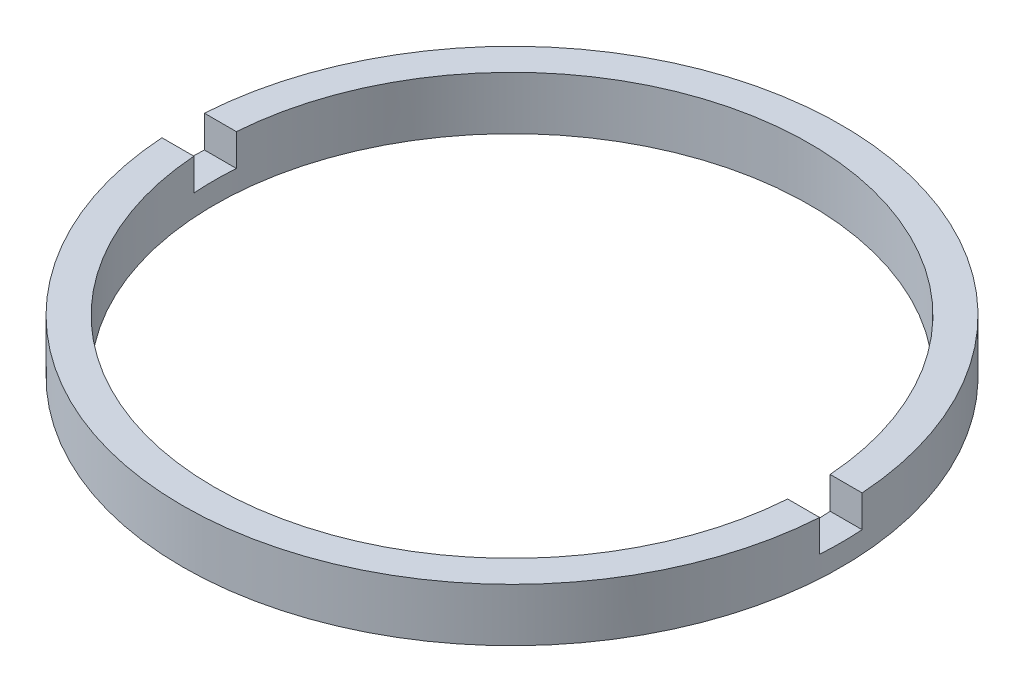
ISO-10303-21;
HEADER;
FILE_DESCRIPTION(('STEP AP214'),'2;1');
FILE_NAME('part.step','',(''),(''),'','','');
FILE_SCHEMA(('AUTOMOTIVE_DESIGN { 1 0 10303 214 1 1 1 1 }'));
ENDSEC;
DATA;
#1=APPLICATION_CONTEXT('core data for automotive mechanical design processes');
#2=APPLICATION_PROTOCOL_DEFINITION('international standard','automotive_design',2000,#1);
#3=PRODUCT_CONTEXT('',#1,'mechanical');
#4=PRODUCT('Part','Part','',(#3));
#5=PRODUCT_RELATED_PRODUCT_CATEGORY('part','',(#4));
#6=PRODUCT_DEFINITION_FORMATION('','',#4);
#7=PRODUCT_DEFINITION_CONTEXT('part definition',#1,'design');
#8=PRODUCT_DEFINITION('design','',#6,#7);
#9=PRODUCT_DEFINITION_SHAPE('','',#8);
#10=(LENGTH_UNIT() NAMED_UNIT(*) SI_UNIT(.MILLI.,.METRE.));
#11=(NAMED_UNIT(*) PLANE_ANGLE_UNIT() SI_UNIT($,.RADIAN.));
#12=(NAMED_UNIT(*) SI_UNIT($,.STERADIAN.) SOLID_ANGLE_UNIT());
#13=UNCERTAINTY_MEASURE_WITH_UNIT(LENGTH_MEASURE(1.E-05),#10,'distance_accuracy_value','');
#14=(GEOMETRIC_REPRESENTATION_CONTEXT(3) GLOBAL_UNCERTAINTY_ASSIGNED_CONTEXT((#13)) GLOBAL_UNIT_ASSIGNED_CONTEXT((#10,
#11,#12)) REPRESENTATION_CONTEXT('',''));
#15=CARTESIAN_POINT('',(0.,0.,0.));
#16=DIRECTION('',(0.,0.,1.));
#17=DIRECTION('',(1.,0.,0.));
#18=AXIS2_PLACEMENT_3D('',#15,#16,#17);
#19=CARTESIAN_POINT('',(14.,-1.96424978717943,0.));
#20=DIRECTION('',(0.,-1.,0.));
#21=DIRECTION('',(0.,0.,-1.));
#22=AXIS2_PLACEMENT_3D('',#19,#20,#21);
#23=PLANE('',#22);
#24=CARTESIAN_POINT('',(0.,-1.96424978717943,0.));
#25=DIRECTION('',(0.,1.,0.));
#26=DIRECTION('',(0.,0.,1.));
#27=AXIS2_PLACEMENT_3D('',#24,#25,#26);
#28=CIRCLE('',#27,15.5);
#29=CARTESIAN_POINT('',(-15.467708298258,-1.96424978717943,1.));
#30=VERTEX_POINT('',#29);
#31=CARTESIAN_POINT('',(15.467708298258,-1.96424978717943,1.));
#32=VERTEX_POINT('',#31);
#33=EDGE_CURVE('E126',#30,#32,#28,.T.);
#34=ORIENTED_EDGE('',*,*,#33,.T.);
#35=DIRECTION('',(1.,0.,0.));
#36=VECTOR('',#35,1.);
#37=CARTESIAN_POINT('',(-26.8525402726146,-1.96424978717943,1.));
#38=LINE('',#37,#36);
#39=CARTESIAN_POINT('',(13.9642400437689,-1.96424978717943,1.));
#40=VERTEX_POINT('',#39);
#41=EDGE_CURVE('E119',#40,#32,#38,.T.);
#42=ORIENTED_EDGE('',*,*,#41,.F.);
#43=CARTESIAN_POINT('',(0.,-1.96424978717943,0.));
#44=DIRECTION('',(0.,1.,0.));
#45=DIRECTION('',(0.,0.,1.));
#46=AXIS2_PLACEMENT_3D('',#43,#44,#45);
#47=CIRCLE('',#46,14.);
#48=CARTESIAN_POINT('',(-13.9642400437689,-1.96424978717943,1.));
#49=VERTEX_POINT('',#48);
#50=EDGE_CURVE('E133',#49,#40,#47,.T.);
#51=ORIENTED_EDGE('',*,*,#50,.F.);
#52=EDGE_CURVE('E148',#30,#49,#38,.T.);
#53=ORIENTED_EDGE('',*,*,#52,.F.);
#54=EDGE_LOOP('',(#34,#42,#51,#53));
#55=FACE_BOUND('',#54,.T.);
#56=ADVANCED_FACE('F36',(#55),#23,.F.);
#57=CARTESIAN_POINT('',(0.,56.2608426270136,0.));
#58=DIRECTION('',(0.,1.,0.));
#59=DIRECTION('',(0.,0.,1.));
#60=AXIS2_PLACEMENT_3D('',#57,#58,#59);
#61=CYLINDRICAL_SURFACE('',#60,15.5);
#62=CARTESIAN_POINT('',(0.,-3.46424978717943,0.));
#63=DIRECTION('',(0.,1.,0.));
#64=DIRECTION('',(0.,0.,1.));
#65=AXIS2_PLACEMENT_3D('',#62,#63,#64);
#66=CIRCLE('',#65,15.5);
#67=CARTESIAN_POINT('',(15.467708298258,-3.46424978717943,1.));
#68=VERTEX_POINT('',#67);
#69=CARTESIAN_POINT('',(15.467708298258,-3.46424978717943,-1.));
#70=VERTEX_POINT('',#69);
#71=EDGE_CURVE('E109',#68,#70,#66,.T.);
#72=ORIENTED_EDGE('',*,*,#71,.F.);
#73=DIRECTION('',(0.,1.,0.));
#74=VECTOR('',#73,1.);
#75=CARTESIAN_POINT('',(15.467708298258,56.2608426270136,1.));
#76=LINE('',#75,#74);
#77=EDGE_CURVE('E161',#68,#32,#76,.T.);
#78=ORIENTED_EDGE('',*,*,#77,.T.);
#79=ORIENTED_EDGE('',*,*,#33,.F.);
#80=DIRECTION('',(0.,1.,0.));
#81=VECTOR('',#80,1.);
#82=CARTESIAN_POINT('',(-15.467708298258,56.2608426270136,1.));
#83=LINE('',#82,#81);
#84=CARTESIAN_POINT('',(-15.467708298258,-3.46424978717943,1.));
#85=VERTEX_POINT('',#84);
#86=EDGE_CURVE('E158',#30,#85,#83,.F.);
#87=ORIENTED_EDGE('',*,*,#86,.T.);
#88=CARTESIAN_POINT('',(-15.467708298258,-3.46424978717943,-1.));
#89=VERTEX_POINT('',#88);
#90=EDGE_CURVE('E155',#89,#85,#66,.T.);
#91=ORIENTED_EDGE('',*,*,#90,.F.);
#92=DIRECTION('',(0.,1.,0.));
#93=VECTOR('',#92,1.);
#94=CARTESIAN_POINT('',(-15.467708298258,56.2608426270136,-1.));
#95=LINE('',#94,#93);
#96=CARTESIAN_POINT('',(-15.467708298258,-1.96424978717943,-1.));
#97=VERTEX_POINT('',#96);
#98=EDGE_CURVE('E108',#89,#97,#95,.T.);
#99=ORIENTED_EDGE('',*,*,#98,.T.);
#100=CARTESIAN_POINT('',(15.467708298258,-1.96424978717943,-1.));
#101=VERTEX_POINT('',#100);
#102=EDGE_CURVE('E116',#101,#97,#28,.T.);
#103=ORIENTED_EDGE('',*,*,#102,.F.);
#104=DIRECTION('',(0.,1.,0.));
#105=VECTOR('',#104,1.);
#106=CARTESIAN_POINT('',(15.467708298258,56.2608426270136,-1.));
#107=LINE('',#106,#105);
#108=EDGE_CURVE('E100',#101,#70,#107,.F.);
#109=ORIENTED_EDGE('',*,*,#108,.T.);
#110=EDGE_LOOP('',(#72,#78,#79,#87,#91,#99,#103,#109));
#111=FACE_BOUND('',#110,.T.);
#112=CARTESIAN_POINT('',(0.,-4.46424978717943,0.));
#113=DIRECTION('',(0.,1.,0.));
#114=DIRECTION('',(0.,0.,1.));
#115=AXIS2_PLACEMENT_3D('',#112,#113,#114);
#116=CIRCLE('',#115,15.5);
#117=CARTESIAN_POINT('',(0.,-4.46424978717943,15.5));
#118=VERTEX_POINT('',#117);
#119=EDGE_CURVE('E164',#118,#118,#116,.T.);
#120=ORIENTED_EDGE('',*,*,#119,.T.);
#121=EDGE_LOOP('',(#120));
#122=FACE_BOUND('',#121,.T.);
#123=ADVANCED_FACE('F38',(#111,#122),#61,.T.);
#124=ORIENTED_EDGE('',*,*,#102,.T.);
#125=DIRECTION('',(-1.,0.,0.));
#126=VECTOR('',#125,1.);
#127=CARTESIAN_POINT('',(-26.8525402726146,-1.96424978717943,-1.));
#128=LINE('',#127,#126);
#129=CARTESIAN_POINT('',(-13.9642400437689,-1.96424978717943,-1.));
#130=VERTEX_POINT('',#129);
#131=EDGE_CURVE('E120',#130,#97,#128,.T.);
#132=ORIENTED_EDGE('',*,*,#131,.F.);
#133=CARTESIAN_POINT('',(13.9642400437689,-1.96424978717943,-1.));
#134=VERTEX_POINT('',#133);
#135=EDGE_CURVE('E118',#134,#130,#47,.T.);
#136=ORIENTED_EDGE('',*,*,#135,.F.);
#137=EDGE_CURVE('E103',#101,#134,#128,.T.);
#138=ORIENTED_EDGE('',*,*,#137,.F.);
#139=EDGE_LOOP('',(#124,#132,#136,#138));
#140=FACE_BOUND('',#139,.T.);
#141=ADVANCED_FACE('F114',(#140),#23,.F.);
#142=CARTESIAN_POINT('',(0.,56.2608426270136,0.));
#143=DIRECTION('',(0.,1.,0.));
#144=DIRECTION('',(0.,0.,1.));
#145=AXIS2_PLACEMENT_3D('',#142,#143,#144);
#146=CYLINDRICAL_SURFACE('',#145,14.);
#147=CARTESIAN_POINT('',(0.,-3.46424978717943,0.));
#148=DIRECTION('',(0.,1.,0.));
#149=DIRECTION('',(0.,0.,1.));
#150=AXIS2_PLACEMENT_3D('',#147,#148,#149);
#151=CIRCLE('',#150,14.);
#152=CARTESIAN_POINT('',(-13.9642400437689,-3.46424978717943,1.));
#153=VERTEX_POINT('',#152);
#154=CARTESIAN_POINT('',(-13.9642400437689,-3.46424978717943,-1.));
#155=VERTEX_POINT('',#154);
#156=EDGE_CURVE('E130',#153,#155,#151,.F.);
#157=ORIENTED_EDGE('',*,*,#156,.F.);
#158=DIRECTION('',(0.,1.,0.));
#159=VECTOR('',#158,1.);
#160=CARTESIAN_POINT('',(-13.9642400437689,56.2608426270136,1.));
#161=LINE('',#160,#159);
#162=EDGE_CURVE('E11',#153,#49,#161,.T.);
#163=ORIENTED_EDGE('',*,*,#162,.T.);
#164=ORIENTED_EDGE('',*,*,#50,.T.);
#165=DIRECTION('',(0.,1.,0.));
#166=VECTOR('',#165,1.);
#167=CARTESIAN_POINT('',(13.9642400437689,56.2608426270136,1.));
#168=LINE('',#167,#166);
#169=CARTESIAN_POINT('',(13.9642400437689,-3.46424978717943,1.));
#170=VERTEX_POINT('',#169);
#171=EDGE_CURVE('E137',#40,#170,#168,.F.);
#172=ORIENTED_EDGE('',*,*,#171,.T.);
#173=CARTESIAN_POINT('',(13.9642400437689,-3.46424978717943,-1.));
#174=VERTEX_POINT('',#173);
#175=EDGE_CURVE('E125',#174,#170,#151,.F.);
#176=ORIENTED_EDGE('',*,*,#175,.F.);
#177=DIRECTION('',(0.,1.,0.));
#178=VECTOR('',#177,1.);
#179=CARTESIAN_POINT('',(13.9642400437689,56.2608426270136,-1.));
#180=LINE('',#179,#178);
#181=EDGE_CURVE('E128',#174,#134,#180,.T.);
#182=ORIENTED_EDGE('',*,*,#181,.T.);
#183=ORIENTED_EDGE('',*,*,#135,.T.);
#184=DIRECTION('',(0.,1.,0.));
#185=VECTOR('',#184,1.);
#186=CARTESIAN_POINT('',(-13.9642400437689,56.2608426270136,-1.));
#187=LINE('',#186,#185);
#188=EDGE_CURVE('E44',#130,#155,#187,.F.);
#189=ORIENTED_EDGE('',*,*,#188,.T.);
#190=EDGE_LOOP('',(#157,#163,#164,#172,#176,#182,#183,#189));
#191=FACE_BOUND('',#190,.T.);
#192=CARTESIAN_POINT('',(0.,-4.46424978717943,0.));
#193=DIRECTION('',(0.,1.,0.));
#194=DIRECTION('',(0.,0.,1.));
#195=AXIS2_PLACEMENT_3D('',#192,#193,#194);
#196=CIRCLE('',#195,14.);
#197=CARTESIAN_POINT('',(0.,-4.46424978717943,14.));
#198=VERTEX_POINT('',#197);
#199=EDGE_CURVE('E166',#198,#198,#196,.T.);
#200=ORIENTED_EDGE('',*,*,#199,.F.);
#201=EDGE_LOOP('',(#200));
#202=FACE_BOUND('',#201,.T.);
#203=ADVANCED_FACE('F172',(#191,#202),#146,.F.);
#204=CARTESIAN_POINT('',(14.,-4.46424978717943,0.));
#205=DIRECTION('',(0.,1.,0.));
#206=DIRECTION('',(0.,0.,1.));
#207=AXIS2_PLACEMENT_3D('',#204,#205,#206);
#208=PLANE('',#207);
#209=ORIENTED_EDGE('',*,*,#119,.F.);
#210=EDGE_LOOP('',(#209));
#211=FACE_BOUND('',#210,.T.);
#212=ORIENTED_EDGE('',*,*,#199,.T.);
#213=EDGE_LOOP('',(#212));
#214=FACE_BOUND('',#213,.T.);
#215=ADVANCED_FACE('F202',(#211,#214),#208,.F.);
#216=CARTESIAN_POINT('',(0.,-3.46424978717943,0.));
#217=DIRECTION('',(0.,1.,0.));
#218=DIRECTION('',(0.,0.,1.));
#219=AXIS2_PLACEMENT_3D('',#216,#217,#218);
#220=PLANE('',#219);
#221=ORIENTED_EDGE('',*,*,#71,.T.);
#222=DIRECTION('',(-1.,0.,0.));
#223=VECTOR('',#222,1.);
#224=CARTESIAN_POINT('',(-26.8525402726146,-3.46424978717943,-1.));
#225=LINE('',#224,#223);
#226=EDGE_CURVE('E59',#70,#174,#225,.T.);
#227=ORIENTED_EDGE('',*,*,#226,.T.);
#228=ORIENTED_EDGE('',*,*,#175,.T.);
#229=DIRECTION('',(1.,0.,0.));
#230=VECTOR('',#229,1.);
#231=CARTESIAN_POINT('',(-26.8525402726146,-3.46424978717943,1.));
#232=LINE('',#231,#230);
#233=EDGE_CURVE('E150',#170,#68,#232,.T.);
#234=ORIENTED_EDGE('',*,*,#233,.T.);
#235=EDGE_LOOP('',(#221,#227,#228,#234));
#236=FACE_BOUND('',#235,.T.);
#237=ADVANCED_FACE('F176',(#236),#220,.T.);
#238=CARTESIAN_POINT('',(-26.8525402726146,-3.46424978717943,-1.));
#239=DIRECTION('',(0.,0.,-1.));
#240=DIRECTION('',(-1.,0.,0.));
#241=AXIS2_PLACEMENT_3D('',#238,#239,#240);
#242=PLANE('',#241);
#243=ORIENTED_EDGE('',*,*,#137,.T.);
#244=ORIENTED_EDGE('',*,*,#181,.F.);
#245=ORIENTED_EDGE('',*,*,#226,.F.);
#246=ORIENTED_EDGE('',*,*,#108,.F.);
#247=EDGE_LOOP('',(#243,#244,#245,#246));
#248=FACE_BOUND('',#247,.T.);
#249=ADVANCED_FACE('F102',(#248),#242,.F.);
#250=CARTESIAN_POINT('',(-26.8525402726146,-3.46424978717943,1.));
#251=DIRECTION('',(0.,0.,1.));
#252=DIRECTION('',(1.,0.,0.));
#253=AXIS2_PLACEMENT_3D('',#250,#251,#252);
#254=PLANE('',#253);
#255=ORIENTED_EDGE('',*,*,#233,.F.);
#256=ORIENTED_EDGE('',*,*,#171,.F.);
#257=ORIENTED_EDGE('',*,*,#41,.T.);
#258=ORIENTED_EDGE('',*,*,#77,.F.);
#259=EDGE_LOOP('',(#255,#256,#257,#258));
#260=FACE_BOUND('',#259,.T.);
#261=ADVANCED_FACE('F178',(#260),#254,.F.);
#262=ORIENTED_EDGE('',*,*,#52,.T.);
#263=ORIENTED_EDGE('',*,*,#162,.F.);
#264=EDGE_CURVE('E51',#85,#153,#232,.T.);
#265=ORIENTED_EDGE('',*,*,#264,.F.);
#266=ORIENTED_EDGE('',*,*,#86,.F.);
#267=EDGE_LOOP('',(#262,#263,#265,#266));
#268=FACE_BOUND('',#267,.T.);
#269=ADVANCED_FACE('F184',(#268),#254,.F.);
#270=EDGE_CURVE('E145',#155,#89,#225,.T.);
#271=ORIENTED_EDGE('',*,*,#270,.F.);
#272=ORIENTED_EDGE('',*,*,#188,.F.);
#273=ORIENTED_EDGE('',*,*,#131,.T.);
#274=ORIENTED_EDGE('',*,*,#98,.F.);
#275=EDGE_LOOP('',(#271,#272,#273,#274));
#276=FACE_BOUND('',#275,.T.);
#277=ADVANCED_FACE('F147',(#276),#242,.F.);
#278=ORIENTED_EDGE('',*,*,#90,.T.);
#279=ORIENTED_EDGE('',*,*,#264,.T.);
#280=ORIENTED_EDGE('',*,*,#156,.T.);
#281=ORIENTED_EDGE('',*,*,#270,.T.);
#282=EDGE_LOOP('',(#278,#279,#280,#281));
#283=FACE_BOUND('',#282,.T.);
#284=ADVANCED_FACE('F144',(#283),#220,.T.);
#285=CLOSED_SHELL('',(#56,#123,#141,#203,#215,#237,#249,#261,#269,#277,#284));
#286=MANIFOLD_SOLID_BREP('B2',#285);
#287=ADVANCED_BREP_SHAPE_REPRESENTATION('',(#18,#286),#14);
#288=SHAPE_DEFINITION_REPRESENTATION(#9,#287);
ENDSEC;
END-ISO-10303-21;
